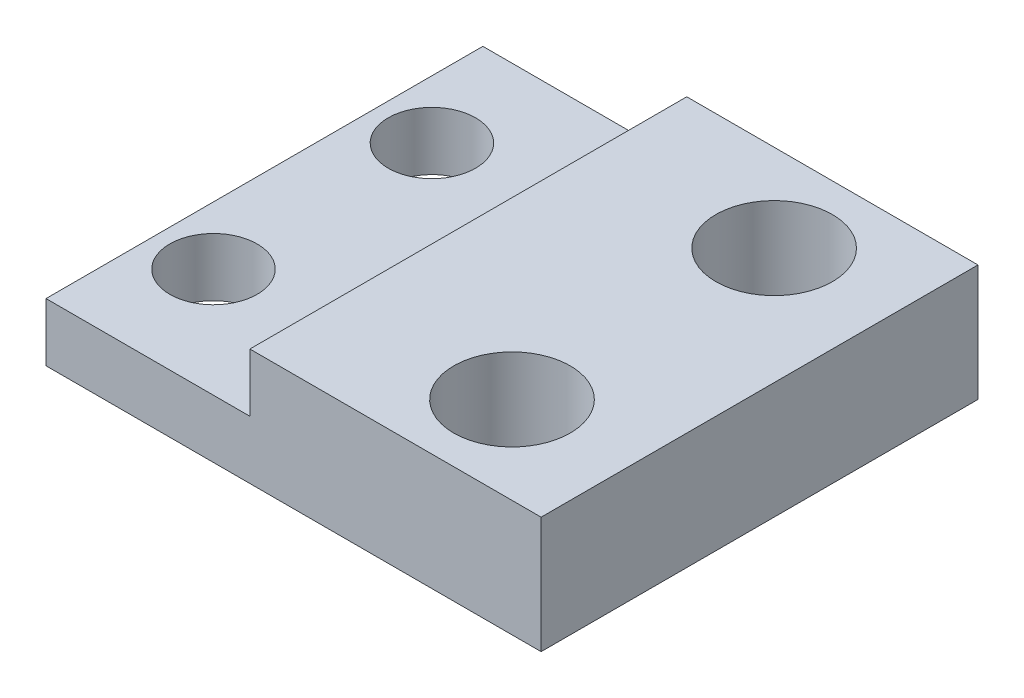
ISO-10303-21;
HEADER;
FILE_DESCRIPTION(('STEP AP214'),'2;1');
FILE_NAME('part.step','',(''),(''),'','','');
FILE_SCHEMA(('AUTOMOTIVE_DESIGN { 1 0 10303 214 1 1 1 1 }'));
ENDSEC;
DATA;
#1=APPLICATION_CONTEXT('core data for automotive mechanical design processes');
#2=APPLICATION_PROTOCOL_DEFINITION('international standard','automotive_design',2000,#1);
#3=PRODUCT_CONTEXT('',#1,'mechanical');
#4=PRODUCT('Part','Part','',(#3));
#5=PRODUCT_RELATED_PRODUCT_CATEGORY('part','',(#4));
#6=PRODUCT_DEFINITION_FORMATION('','',#4);
#7=PRODUCT_DEFINITION_CONTEXT('part definition',#1,'design');
#8=PRODUCT_DEFINITION('design','',#6,#7);
#9=PRODUCT_DEFINITION_SHAPE('','',#8);
#10=(LENGTH_UNIT() NAMED_UNIT(*) SI_UNIT(.MILLI.,.METRE.));
#11=(NAMED_UNIT(*) PLANE_ANGLE_UNIT() SI_UNIT($,.RADIAN.));
#12=(NAMED_UNIT(*) SI_UNIT($,.STERADIAN.) SOLID_ANGLE_UNIT());
#13=UNCERTAINTY_MEASURE_WITH_UNIT(LENGTH_MEASURE(1.E-05),#10,'distance_accuracy_value','');
#14=(GEOMETRIC_REPRESENTATION_CONTEXT(3) GLOBAL_UNCERTAINTY_ASSIGNED_CONTEXT((#13)) GLOBAL_UNIT_ASSIGNED_CONTEXT((#10,
#11,#12)) REPRESENTATION_CONTEXT('',''));
#15=CARTESIAN_POINT('',(0.,0.,0.));
#16=DIRECTION('',(0.,0.,1.));
#17=DIRECTION('',(1.,0.,0.));
#18=AXIS2_PLACEMENT_3D('',#15,#16,#17);
#19=CARTESIAN_POINT('',(0.,4.,0.));
#20=DIRECTION('',(0.,1.,0.));
#21=DIRECTION('',(0.,0.,1.));
#22=AXIS2_PLACEMENT_3D('',#19,#20,#21);
#23=PLANE('',#22);
#24=CARTESIAN_POINT('',(6.,4.,4.5));
#25=DIRECTION('',(0.,1.,0.));
#26=DIRECTION('',(0.,0.,1.));
#27=AXIS2_PLACEMENT_3D('',#24,#25,#26);
#28=CIRCLE('',#27,2.);
#29=CARTESIAN_POINT('',(6.,4.,6.5));
#30=VERTEX_POINT('',#29);
#31=EDGE_CURVE('E112',#30,#30,#28,.T.);
#32=ORIENTED_EDGE('',*,*,#31,.F.);
#33=EDGE_LOOP('',(#32));
#34=FACE_BOUND('',#33,.T.);
#35=CARTESIAN_POINT('',(6.,4.,-4.5));
#36=DIRECTION('',(0.,1.,0.));
#37=DIRECTION('',(0.,0.,1.));
#38=AXIS2_PLACEMENT_3D('',#35,#36,#37);
#39=CIRCLE('',#38,2.);
#40=CARTESIAN_POINT('',(6.,4.,-2.5));
#41=VERTEX_POINT('',#40);
#42=EDGE_CURVE('E108',#41,#41,#39,.T.);
#43=ORIENTED_EDGE('',*,*,#42,.F.);
#44=EDGE_LOOP('',(#43));
#45=FACE_BOUND('',#44,.T.);
#46=DIRECTION('',(-1.,0.,0.));
#47=VECTOR('',#46,1.);
#48=CARTESIAN_POINT('',(-10.,4.,-7.5));
#49=LINE('',#48,#47);
#50=CARTESIAN_POINT('',(9.99999999999999,4.,-7.5));
#51=VERTEX_POINT('',#50);
#52=CARTESIAN_POINT('',(0.,4.,-7.5));
#53=VERTEX_POINT('',#52);
#54=EDGE_CURVE('E102',#51,#53,#49,.T.);
#55=ORIENTED_EDGE('',*,*,#54,.T.);
#56=DIRECTION('',(0.,0.,1.));
#57=VECTOR('',#56,1.);
#58=CARTESIAN_POINT('',(0.,4.,-7.5));
#59=LINE('',#58,#57);
#60=CARTESIAN_POINT('',(0.,4.,7.5));
#61=VERTEX_POINT('',#60);
#62=EDGE_CURVE('E123',#53,#61,#59,.T.);
#63=ORIENTED_EDGE('',*,*,#62,.T.);
#64=DIRECTION('',(1.,0.,0.));
#65=VECTOR('',#64,1.);
#66=CARTESIAN_POINT('',(-10.,4.,7.5));
#67=LINE('',#66,#65);
#68=CARTESIAN_POINT('',(9.99999999999999,4.,7.5));
#69=VERTEX_POINT('',#68);
#70=EDGE_CURVE('E62',#61,#69,#67,.T.);
#71=ORIENTED_EDGE('',*,*,#70,.T.);
#72=DIRECTION('',(0.,0.,-1.));
#73=VECTOR('',#72,1.);
#74=CARTESIAN_POINT('',(9.99999999999999,4.,-7.5));
#75=LINE('',#74,#73);
#76=EDGE_CURVE('E84',#69,#51,#75,.T.);
#77=ORIENTED_EDGE('',*,*,#76,.T.);
#78=EDGE_LOOP('',(#55,#63,#71,#77));
#79=FACE_BOUND('',#78,.T.);
#80=ADVANCED_FACE('F37',(#34,#45,#79),#23,.T.);
#81=CARTESIAN_POINT('',(0.,0.,0.));
#82=DIRECTION('',(0.,1.,0.));
#83=DIRECTION('',(0.,0.,1.));
#84=AXIS2_PLACEMENT_3D('',#81,#82,#83);
#85=PLANE('',#84);
#86=CARTESIAN_POINT('',(6.,0.,4.5));
#87=DIRECTION('',(0.,1.,0.));
#88=DIRECTION('',(0.,0.,1.));
#89=AXIS2_PLACEMENT_3D('',#86,#87,#88);
#90=CIRCLE('',#89,2.);
#91=CARTESIAN_POINT('',(6.,0.,6.5));
#92=VERTEX_POINT('',#91);
#93=EDGE_CURVE('E115',#92,#92,#90,.T.);
#94=ORIENTED_EDGE('',*,*,#93,.T.);
#95=EDGE_LOOP('',(#94));
#96=FACE_BOUND('',#95,.T.);
#97=CARTESIAN_POINT('',(6.,0.,-4.5));
#98=DIRECTION('',(0.,1.,0.));
#99=DIRECTION('',(0.,0.,1.));
#100=AXIS2_PLACEMENT_3D('',#97,#98,#99);
#101=CIRCLE('',#100,2.);
#102=CARTESIAN_POINT('',(6.,0.,-2.5));
#103=VERTEX_POINT('',#102);
#104=EDGE_CURVE('E109',#103,#103,#101,.T.);
#105=ORIENTED_EDGE('',*,*,#104,.T.);
#106=EDGE_LOOP('',(#105));
#107=FACE_BOUND('',#106,.T.);
#108=CARTESIAN_POINT('',(-5.,0.,3.75));
#109=DIRECTION('',(0.,1.,0.));
#110=DIRECTION('',(0.,0.,1.));
#111=AXIS2_PLACEMENT_3D('',#108,#109,#110);
#112=CIRCLE('',#111,1.5);
#113=CARTESIAN_POINT('',(-5.,0.,5.25));
#114=VERTEX_POINT('',#113);
#115=EDGE_CURVE('E98',#114,#114,#112,.T.);
#116=ORIENTED_EDGE('',*,*,#115,.T.);
#117=EDGE_LOOP('',(#116));
#118=FACE_BOUND('',#117,.T.);
#119=CARTESIAN_POINT('',(-5.,0.,-3.75));
#120=DIRECTION('',(0.,1.,0.));
#121=DIRECTION('',(0.,0.,1.));
#122=AXIS2_PLACEMENT_3D('',#119,#120,#121);
#123=CIRCLE('',#122,1.5);
#124=CARTESIAN_POINT('',(-5.,0.,-2.25));
#125=VERTEX_POINT('',#124);
#126=EDGE_CURVE('E94',#125,#125,#123,.T.);
#127=ORIENTED_EDGE('',*,*,#126,.T.);
#128=EDGE_LOOP('',(#127));
#129=FACE_BOUND('',#128,.T.);
#130=DIRECTION('',(0.,0.,1.));
#131=VECTOR('',#130,1.);
#132=CARTESIAN_POINT('',(-7.00000000000001,0.,-7.5));
#133=LINE('',#132,#131);
#134=CARTESIAN_POINT('',(-7.00000000000001,0.,-7.5));
#135=VERTEX_POINT('',#134);
#136=CARTESIAN_POINT('',(-7.00000000000001,0.,7.5));
#137=VERTEX_POINT('',#136);
#138=EDGE_CURVE('E53',#135,#137,#133,.T.);
#139=ORIENTED_EDGE('',*,*,#138,.F.);
#140=DIRECTION('',(-1.,0.,0.));
#141=VECTOR('',#140,1.);
#142=CARTESIAN_POINT('',(-10.,0.,-7.5));
#143=LINE('',#142,#141);
#144=CARTESIAN_POINT('',(9.99999999999999,0.,-7.5));
#145=VERTEX_POINT('',#144);
#146=EDGE_CURVE('E85',#145,#135,#143,.T.);
#147=ORIENTED_EDGE('',*,*,#146,.F.);
#148=DIRECTION('',(0.,0.,-1.));
#149=VECTOR('',#148,1.);
#150=CARTESIAN_POINT('',(9.99999999999999,0.,-7.5));
#151=LINE('',#150,#149);
#152=CARTESIAN_POINT('',(9.99999999999999,0.,7.5));
#153=VERTEX_POINT('',#152);
#154=EDGE_CURVE('E90',#153,#145,#151,.T.);
#155=ORIENTED_EDGE('',*,*,#154,.F.);
#156=DIRECTION('',(1.,0.,0.));
#157=VECTOR('',#156,1.);
#158=CARTESIAN_POINT('',(-10.,0.,7.5));
#159=LINE('',#158,#157);
#160=EDGE_CURVE('E75',#137,#153,#159,.T.);
#161=ORIENTED_EDGE('',*,*,#160,.F.);
#162=EDGE_LOOP('',(#139,#147,#155,#161));
#163=FACE_BOUND('',#162,.T.);
#164=ADVANCED_FACE('F92',(#96,#107,#118,#129,#163),#85,.F.);
#165=CARTESIAN_POINT('',(-10.,4.,-7.5));
#166=DIRECTION('',(0.,0.,1.));
#167=DIRECTION('',(1.,0.,0.));
#168=AXIS2_PLACEMENT_3D('',#165,#166,#167);
#169=PLANE('',#168);
#170=DIRECTION('',(0.,-1.,0.));
#171=VECTOR('',#170,1.);
#172=CARTESIAN_POINT('',(0.,4.,-7.5));
#173=LINE('',#172,#171);
#174=CARTESIAN_POINT('',(0.,2.,-7.5));
#175=VERTEX_POINT('',#174);
#176=EDGE_CURVE('E134',#53,#175,#173,.T.);
#177=ORIENTED_EDGE('',*,*,#176,.F.);
#178=ORIENTED_EDGE('',*,*,#54,.F.);
#179=DIRECTION('',(0.,-1.,0.));
#180=VECTOR('',#179,1.);
#181=CARTESIAN_POINT('',(9.99999999999999,4.,-7.5));
#182=LINE('',#181,#180);
#183=EDGE_CURVE('E11',#51,#145,#182,.T.);
#184=ORIENTED_EDGE('',*,*,#183,.T.);
#185=ORIENTED_EDGE('',*,*,#146,.T.);
#186=DIRECTION('',(0.,-1.,0.));
#187=VECTOR('',#186,1.);
#188=CARTESIAN_POINT('',(-7.00000000000001,2.,-7.5));
#189=LINE('',#188,#187);
#190=CARTESIAN_POINT('',(-7.00000000000001,2.,-7.5));
#191=VERTEX_POINT('',#190);
#192=EDGE_CURVE('E132',#191,#135,#189,.T.);
#193=ORIENTED_EDGE('',*,*,#192,.F.);
#194=DIRECTION('',(-1.,0.,0.));
#195=VECTOR('',#194,1.);
#196=CARTESIAN_POINT('',(0.,2.,-7.5));
#197=LINE('',#196,#195);
#198=EDGE_CURVE('E140',#175,#191,#197,.T.);
#199=ORIENTED_EDGE('',*,*,#198,.F.);
#200=EDGE_LOOP('',(#177,#178,#184,#185,#193,#199));
#201=FACE_BOUND('',#200,.T.);
#202=ADVANCED_FACE('F162',(#201),#169,.F.);
#203=CARTESIAN_POINT('',(-10.,4.,7.5));
#204=DIRECTION('',(0.,0.,-1.));
#205=DIRECTION('',(-1.,0.,0.));
#206=AXIS2_PLACEMENT_3D('',#203,#204,#205);
#207=PLANE('',#206);
#208=DIRECTION('',(0.,-1.,0.));
#209=VECTOR('',#208,1.);
#210=CARTESIAN_POINT('',(0.,4.,7.5));
#211=LINE('',#210,#209);
#212=CARTESIAN_POINT('',(0.,2.,7.5));
#213=VERTEX_POINT('',#212);
#214=EDGE_CURVE('E137',#61,#213,#211,.T.);
#215=ORIENTED_EDGE('',*,*,#214,.T.);
#216=DIRECTION('',(-1.,0.,0.));
#217=VECTOR('',#216,1.);
#218=CARTESIAN_POINT('',(0.,2.,7.5));
#219=LINE('',#218,#217);
#220=CARTESIAN_POINT('',(-7.00000000000001,2.,7.5));
#221=VERTEX_POINT('',#220);
#222=EDGE_CURVE('E135',#213,#221,#219,.T.);
#223=ORIENTED_EDGE('',*,*,#222,.T.);
#224=DIRECTION('',(0.,-1.,0.));
#225=VECTOR('',#224,1.);
#226=CARTESIAN_POINT('',(-7.00000000000001,2.,7.5));
#227=LINE('',#226,#225);
#228=EDGE_CURVE('E81',#221,#137,#227,.T.);
#229=ORIENTED_EDGE('',*,*,#228,.T.);
#230=ORIENTED_EDGE('',*,*,#160,.T.);
#231=DIRECTION('',(0.,-1.,0.));
#232=VECTOR('',#231,1.);
#233=CARTESIAN_POINT('',(9.99999999999999,4.,7.5));
#234=LINE('',#233,#232);
#235=EDGE_CURVE('E46',#69,#153,#234,.T.);
#236=ORIENTED_EDGE('',*,*,#235,.F.);
#237=ORIENTED_EDGE('',*,*,#70,.F.);
#238=EDGE_LOOP('',(#215,#223,#229,#230,#236,#237));
#239=FACE_BOUND('',#238,.T.);
#240=ADVANCED_FACE('F78',(#239),#207,.F.);
#241=CARTESIAN_POINT('',(-5.,4.,-3.75));
#242=DIRECTION('',(0.,-1.,0.));
#243=DIRECTION('',(0.,0.,-1.));
#244=AXIS2_PLACEMENT_3D('',#241,#242,#243);
#245=CYLINDRICAL_SURFACE('',#244,1.5);
#246=ORIENTED_EDGE('',*,*,#126,.F.);
#247=EDGE_LOOP('',(#246));
#248=FACE_BOUND('',#247,.T.);
#249=CARTESIAN_POINT('',(-5.,2.,-3.75));
#250=DIRECTION('',(0.,1.,0.));
#251=DIRECTION('',(-1.,0.,0.));
#252=AXIS2_PLACEMENT_3D('',#249,#250,#251);
#253=CIRCLE('',#252,1.5);
#254=CARTESIAN_POINT('',(-6.5,2.,-3.75));
#255=VERTEX_POINT('',#254);
#256=EDGE_CURVE('E118',#255,#255,#253,.T.);
#257=ORIENTED_EDGE('',*,*,#256,.T.);
#258=EDGE_LOOP('',(#257));
#259=FACE_BOUND('',#258,.T.);
#260=ADVANCED_FACE('F182',(#248,#259),#245,.F.);
#261=CARTESIAN_POINT('',(-5.,4.,3.75));
#262=DIRECTION('',(0.,-1.,0.));
#263=DIRECTION('',(0.,0.,-1.));
#264=AXIS2_PLACEMENT_3D('',#261,#262,#263);
#265=CYLINDRICAL_SURFACE('',#264,1.5);
#266=ORIENTED_EDGE('',*,*,#115,.F.);
#267=EDGE_LOOP('',(#266));
#268=FACE_BOUND('',#267,.T.);
#269=CARTESIAN_POINT('',(-5.,2.,3.75));
#270=DIRECTION('',(0.,1.,0.));
#271=DIRECTION('',(-1.,0.,0.));
#272=AXIS2_PLACEMENT_3D('',#269,#270,#271);
#273=CIRCLE('',#272,1.5);
#274=CARTESIAN_POINT('',(-6.5,2.,3.75));
#275=VERTEX_POINT('',#274);
#276=EDGE_CURVE('E41',#275,#275,#273,.T.);
#277=ORIENTED_EDGE('',*,*,#276,.T.);
#278=EDGE_LOOP('',(#277));
#279=FACE_BOUND('',#278,.T.);
#280=ADVANCED_FACE('F201',(#268,#279),#265,.F.);
#281=CARTESIAN_POINT('',(9.99999999999999,4.,-7.5));
#282=DIRECTION('',(-1.,0.,0.));
#283=DIRECTION('',(0.,0.,1.));
#284=AXIS2_PLACEMENT_3D('',#281,#282,#283);
#285=PLANE('',#284);
#286=ORIENTED_EDGE('',*,*,#154,.T.);
#287=ORIENTED_EDGE('',*,*,#183,.F.);
#288=ORIENTED_EDGE('',*,*,#76,.F.);
#289=ORIENTED_EDGE('',*,*,#235,.T.);
#290=EDGE_LOOP('',(#286,#287,#288,#289));
#291=FACE_BOUND('',#290,.T.);
#292=ADVANCED_FACE('F39',(#291),#285,.F.);
#293=CARTESIAN_POINT('',(6.,4.,-4.5));
#294=DIRECTION('',(0.,-1.,0.));
#295=DIRECTION('',(0.,0.,-1.));
#296=AXIS2_PLACEMENT_3D('',#293,#294,#295);
#297=CYLINDRICAL_SURFACE('',#296,2.);
#298=ORIENTED_EDGE('',*,*,#42,.T.);
#299=EDGE_LOOP('',(#298));
#300=FACE_BOUND('',#299,.T.);
#301=ORIENTED_EDGE('',*,*,#104,.F.);
#302=EDGE_LOOP('',(#301));
#303=FACE_BOUND('',#302,.T.);
#304=ADVANCED_FACE('F215',(#300,#303),#297,.F.);
#305=CARTESIAN_POINT('',(6.,4.,4.5));
#306=DIRECTION('',(0.,-1.,0.));
#307=DIRECTION('',(0.,0.,-1.));
#308=AXIS2_PLACEMENT_3D('',#305,#306,#307);
#309=CYLINDRICAL_SURFACE('',#308,2.);
#310=ORIENTED_EDGE('',*,*,#31,.T.);
#311=EDGE_LOOP('',(#310));
#312=FACE_BOUND('',#311,.T.);
#313=ORIENTED_EDGE('',*,*,#93,.F.);
#314=EDGE_LOOP('',(#313));
#315=FACE_BOUND('',#314,.T.);
#316=ADVANCED_FACE('F221',(#312,#315),#309,.F.);
#317=CARTESIAN_POINT('',(0.,4.,-7.5));
#318=DIRECTION('',(-1.,0.,0.));
#319=DIRECTION('',(0.,-1.,0.));
#320=AXIS2_PLACEMENT_3D('',#317,#318,#319);
#321=PLANE('',#320);
#322=ORIENTED_EDGE('',*,*,#214,.F.);
#323=ORIENTED_EDGE('',*,*,#62,.F.);
#324=ORIENTED_EDGE('',*,*,#176,.T.);
#325=DIRECTION('',(0.,0.,1.));
#326=VECTOR('',#325,1.);
#327=CARTESIAN_POINT('',(0.,2.,-7.5));
#328=LINE('',#327,#326);
#329=EDGE_CURVE('E125',#175,#213,#328,.T.);
#330=ORIENTED_EDGE('',*,*,#329,.T.);
#331=EDGE_LOOP('',(#322,#323,#324,#330));
#332=FACE_BOUND('',#331,.T.);
#333=ADVANCED_FACE('F150',(#332),#321,.T.);
#334=CARTESIAN_POINT('',(0.,2.,-7.5));
#335=DIRECTION('',(0.,1.,0.));
#336=DIRECTION('',(-1.,0.,0.));
#337=AXIS2_PLACEMENT_3D('',#334,#335,#336);
#338=PLANE('',#337);
#339=ORIENTED_EDGE('',*,*,#256,.F.);
#340=EDGE_LOOP('',(#339));
#341=FACE_BOUND('',#340,.T.);
#342=ORIENTED_EDGE('',*,*,#276,.F.);
#343=EDGE_LOOP('',(#342));
#344=FACE_BOUND('',#343,.T.);
#345=ORIENTED_EDGE('',*,*,#222,.F.);
#346=ORIENTED_EDGE('',*,*,#329,.F.);
#347=ORIENTED_EDGE('',*,*,#198,.T.);
#348=DIRECTION('',(0.,0.,1.));
#349=VECTOR('',#348,1.);
#350=CARTESIAN_POINT('',(-7.00000000000001,2.,-7.5));
#351=LINE('',#350,#349);
#352=EDGE_CURVE('E128',#191,#221,#351,.T.);
#353=ORIENTED_EDGE('',*,*,#352,.T.);
#354=EDGE_LOOP('',(#345,#346,#347,#353));
#355=FACE_BOUND('',#354,.T.);
#356=ADVANCED_FACE('F159',(#341,#344,#355),#338,.T.);
#357=CARTESIAN_POINT('',(-7.00000000000001,2.,-7.5));
#358=DIRECTION('',(-1.,0.,0.));
#359=DIRECTION('',(0.,0.,1.));
#360=AXIS2_PLACEMENT_3D('',#357,#358,#359);
#361=PLANE('',#360);
#362=ORIENTED_EDGE('',*,*,#228,.F.);
#363=ORIENTED_EDGE('',*,*,#352,.F.);
#364=ORIENTED_EDGE('',*,*,#192,.T.);
#365=ORIENTED_EDGE('',*,*,#138,.T.);
#366=EDGE_LOOP('',(#362,#363,#364,#365));
#367=FACE_BOUND('',#366,.T.);
#368=ADVANCED_FACE('F164',(#367),#361,.T.);
#369=CLOSED_SHELL('',(#80,#164,#202,#240,#260,#280,#292,#304,#316,#333,#356,#368));
#370=MANIFOLD_SOLID_BREP('B2',#369);
#371=ADVANCED_BREP_SHAPE_REPRESENTATION('',(#18,#370),#14);
#372=SHAPE_DEFINITION_REPRESENTATION(#9,#371);
ENDSEC;
END-ISO-10303-21;
